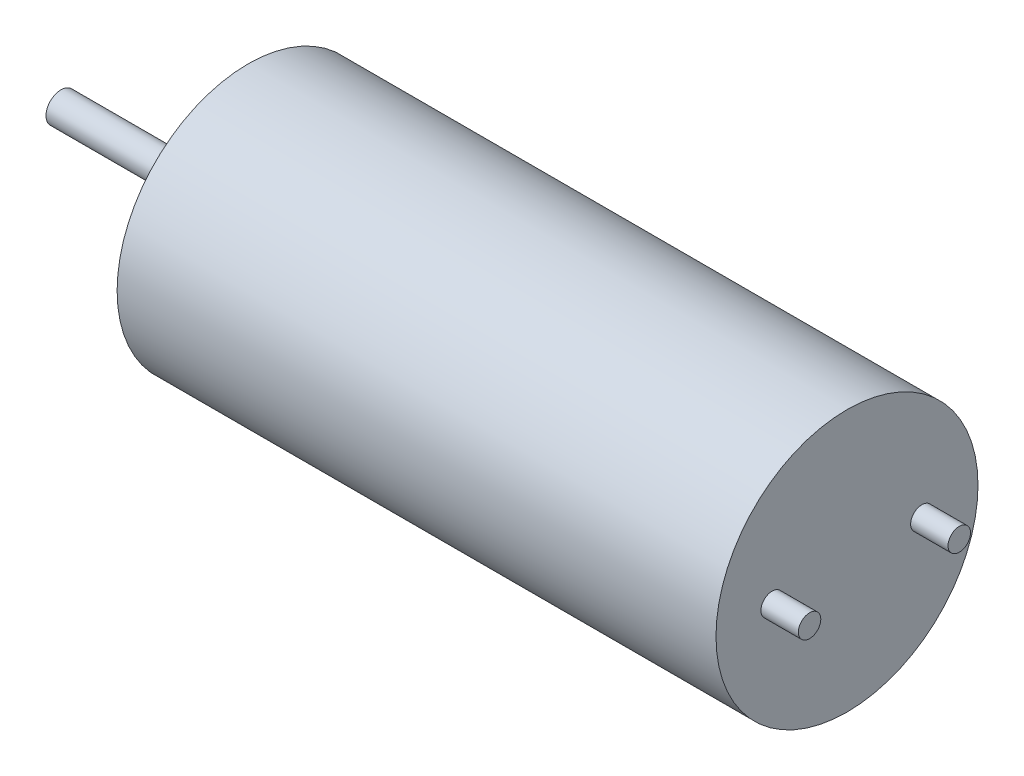
ISO-10303-21;
HEADER;
FILE_DESCRIPTION(('STEP AP214'),'2;1');
FILE_NAME('part.step','',(''),(''),'','','');
FILE_SCHEMA(('AUTOMOTIVE_DESIGN { 1 0 10303 214 1 1 1 1 }'));
ENDSEC;
DATA;
#1=APPLICATION_CONTEXT('core data for automotive mechanical design processes');
#2=APPLICATION_PROTOCOL_DEFINITION('international standard','automotive_design',2000,#1);
#3=PRODUCT_CONTEXT('',#1,'mechanical');
#4=PRODUCT('Part','Part','',(#3));
#5=PRODUCT_RELATED_PRODUCT_CATEGORY('part','',(#4));
#6=PRODUCT_DEFINITION_FORMATION('','',#4);
#7=PRODUCT_DEFINITION_CONTEXT('part definition',#1,'design');
#8=PRODUCT_DEFINITION('design','',#6,#7);
#9=PRODUCT_DEFINITION_SHAPE('','',#8);
#10=(LENGTH_UNIT() NAMED_UNIT(*) SI_UNIT(.MILLI.,.METRE.));
#11=(NAMED_UNIT(*) PLANE_ANGLE_UNIT() SI_UNIT($,.RADIAN.));
#12=(NAMED_UNIT(*) SI_UNIT($,.STERADIAN.) SOLID_ANGLE_UNIT());
#13=UNCERTAINTY_MEASURE_WITH_UNIT(LENGTH_MEASURE(1.E-05),#10,'distance_accuracy_value','');
#14=(GEOMETRIC_REPRESENTATION_CONTEXT(3) GLOBAL_UNCERTAINTY_ASSIGNED_CONTEXT((#13)) GLOBAL_UNIT_ASSIGNED_CONTEXT((#10,
#11,#12)) REPRESENTATION_CONTEXT('',''));
#15=CARTESIAN_POINT('',(0.,0.,0.));
#16=DIRECTION('',(0.,0.,1.));
#17=DIRECTION('',(1.,0.,0.));
#18=AXIS2_PLACEMENT_3D('',#15,#16,#17);
#19=CARTESIAN_POINT('',(16.,0.,0.));
#20=DIRECTION('',(-1.,0.,0.));
#21=DIRECTION('',(0.,0.,1.));
#22=AXIS2_PLACEMENT_3D('',#19,#20,#21);
#23=CYLINDRICAL_SURFACE('',#22,3.5);
#24=CARTESIAN_POINT('',(16.,0.,0.));
#25=DIRECTION('',(1.,0.,0.));
#26=DIRECTION('',(0.,0.,-1.));
#27=AXIS2_PLACEMENT_3D('',#24,#25,#26);
#28=CIRCLE('',#27,3.5);
#29=CARTESIAN_POINT('',(16.,0.,-3.5));
#30=VERTEX_POINT('',#29);
#31=EDGE_CURVE('E51',#30,#30,#28,.T.);
#32=ORIENTED_EDGE('',*,*,#31,.F.);
#33=EDGE_LOOP('',(#32));
#34=FACE_BOUND('',#33,.T.);
#35=CARTESIAN_POINT('',(0.,0.,0.));
#36=DIRECTION('',(1.,0.,0.));
#37=DIRECTION('',(0.,0.,-1.));
#38=AXIS2_PLACEMENT_3D('',#35,#36,#37);
#39=CIRCLE('',#38,3.5);
#40=CARTESIAN_POINT('',(0.,0.,-3.5));
#41=VERTEX_POINT('',#40);
#42=EDGE_CURVE('E40',#41,#41,#39,.T.);
#43=ORIENTED_EDGE('',*,*,#42,.T.);
#44=EDGE_LOOP('',(#43));
#45=FACE_BOUND('',#44,.T.);
#46=ADVANCED_FACE('F37',(#34,#45),#23,.T.);
#47=CARTESIAN_POINT('',(16.,0.,0.));
#48=DIRECTION('',(1.,0.,0.));
#49=DIRECTION('',(0.,0.,-1.));
#50=AXIS2_PLACEMENT_3D('',#47,#48,#49);
#51=PLANE('',#50);
#52=CARTESIAN_POINT('',(16.,0.,-2.));
#53=DIRECTION('',(1.,0.,0.));
#54=DIRECTION('',(0.,0.,-1.));
#55=AXIS2_PLACEMENT_3D('',#52,#53,#54);
#56=CIRCLE('',#55,0.3);
#57=CARTESIAN_POINT('',(16.,0.,-2.3));
#58=VERTEX_POINT('',#57);
#59=EDGE_CURVE('E192',#58,#58,#56,.T.);
#60=ORIENTED_EDGE('',*,*,#59,.F.);
#61=EDGE_LOOP('',(#60));
#62=FACE_BOUND('',#61,.T.);
#63=CARTESIAN_POINT('',(16.,0.,2.));
#64=DIRECTION('',(1.,0.,0.));
#65=DIRECTION('',(0.,0.,-1.));
#66=AXIS2_PLACEMENT_3D('',#63,#64,#65);
#67=CIRCLE('',#66,0.3);
#68=CARTESIAN_POINT('',(16.,0.,1.7));
#69=VERTEX_POINT('',#68);
#70=EDGE_CURVE('E185',#69,#69,#67,.T.);
#71=ORIENTED_EDGE('',*,*,#70,.F.);
#72=EDGE_LOOP('',(#71));
#73=FACE_BOUND('',#72,.T.);
#74=ORIENTED_EDGE('',*,*,#31,.T.);
#75=EDGE_LOOP('',(#74));
#76=FACE_BOUND('',#75,.T.);
#77=ADVANCED_FACE('F72',(#62,#73,#76),#51,.T.);
#78=CARTESIAN_POINT('',(0.,0.,0.));
#79=DIRECTION('',(1.,0.,0.));
#80=DIRECTION('',(0.,0.,-1.));
#81=AXIS2_PLACEMENT_3D('',#78,#79,#80);
#82=PLANE('',#81);
#83=CARTESIAN_POINT('',(0.,0.,0.));
#84=DIRECTION('',(-1.,0.,0.));
#85=DIRECTION('',(0.,0.,1.));
#86=AXIS2_PLACEMENT_3D('',#83,#84,#85);
#87=CIRCLE('',#86,1.2);
#88=CARTESIAN_POINT('',(0.,0.,1.2));
#89=VERTEX_POINT('',#88);
#90=EDGE_CURVE('E45',#89,#89,#87,.T.);
#91=ORIENTED_EDGE('',*,*,#90,.F.);
#92=EDGE_LOOP('',(#91));
#93=FACE_BOUND('',#92,.T.);
#94=ORIENTED_EDGE('',*,*,#42,.F.);
#95=EDGE_LOOP('',(#94));
#96=FACE_BOUND('',#95,.T.);
#97=ADVANCED_FACE('F69',(#93,#96),#82,.F.);
#98=CARTESIAN_POINT('',(-0.8,0.,0.));
#99=DIRECTION('',(1.,0.,0.));
#100=DIRECTION('',(0.,0.,-1.));
#101=AXIS2_PLACEMENT_3D('',#98,#99,#100);
#102=CYLINDRICAL_SURFACE('',#101,1.2);
#103=CARTESIAN_POINT('',(-0.8,0.,0.));
#104=DIRECTION('',(-1.,0.,0.));
#105=DIRECTION('',(0.,0.,1.));
#106=AXIS2_PLACEMENT_3D('',#103,#104,#105);
#107=CIRCLE('',#106,1.2);
#108=CARTESIAN_POINT('',(-0.8,0.,1.2));
#109=VERTEX_POINT('',#108);
#110=EDGE_CURVE('E57',#109,#109,#107,.T.);
#111=ORIENTED_EDGE('',*,*,#110,.F.);
#112=EDGE_LOOP('',(#111));
#113=FACE_BOUND('',#112,.T.);
#114=ORIENTED_EDGE('',*,*,#90,.T.);
#115=EDGE_LOOP('',(#114));
#116=FACE_BOUND('',#115,.T.);
#117=ADVANCED_FACE('F71',(#113,#116),#102,.T.);
#118=CARTESIAN_POINT('',(-0.8,0.,0.));
#119=DIRECTION('',(-1.,0.,0.));
#120=DIRECTION('',(0.,0.,1.));
#121=AXIS2_PLACEMENT_3D('',#118,#119,#120);
#122=PLANE('',#121);
#123=CARTESIAN_POINT('',(-0.8,0.,0.));
#124=DIRECTION('',(-1.,0.,0.));
#125=DIRECTION('',(0.,0.,1.));
#126=AXIS2_PLACEMENT_3D('',#123,#124,#125);
#127=CIRCLE('',#126,0.4);
#128=CARTESIAN_POINT('',(-0.8,0.,0.4));
#129=VERTEX_POINT('',#128);
#130=EDGE_CURVE('E10',#129,#129,#127,.T.);
#131=ORIENTED_EDGE('',*,*,#130,.F.);
#132=EDGE_LOOP('',(#131));
#133=FACE_BOUND('',#132,.T.);
#134=ORIENTED_EDGE('',*,*,#110,.T.);
#135=EDGE_LOOP('',(#134));
#136=FACE_BOUND('',#135,.T.);
#137=ADVANCED_FACE('F78',(#133,#136),#122,.T.);
#138=CARTESIAN_POINT('',(-5.,0.,0.));
#139=DIRECTION('',(1.,0.,0.));
#140=DIRECTION('',(0.,0.,-1.));
#141=AXIS2_PLACEMENT_3D('',#138,#139,#140);
#142=CYLINDRICAL_SURFACE('',#141,0.4);
#143=CARTESIAN_POINT('',(-5.,0.,0.));
#144=DIRECTION('',(-1.,0.,0.));
#145=DIRECTION('',(0.,0.,1.));
#146=AXIS2_PLACEMENT_3D('',#143,#144,#145);
#147=CIRCLE('',#146,0.4);
#148=CARTESIAN_POINT('',(-5.,0.,0.4));
#149=VERTEX_POINT('',#148);
#150=EDGE_CURVE('E55',#149,#149,#147,.T.);
#151=ORIENTED_EDGE('',*,*,#150,.F.);
#152=EDGE_LOOP('',(#151));
#153=FACE_BOUND('',#152,.T.);
#154=ORIENTED_EDGE('',*,*,#130,.T.);
#155=EDGE_LOOP('',(#154));
#156=FACE_BOUND('',#155,.T.);
#157=ADVANCED_FACE('F146',(#153,#156),#142,.T.);
#158=CARTESIAN_POINT('',(-5.,0.,0.));
#159=DIRECTION('',(-1.,0.,0.));
#160=DIRECTION('',(0.,0.,1.));
#161=AXIS2_PLACEMENT_3D('',#158,#159,#160);
#162=PLANE('',#161);
#163=ORIENTED_EDGE('',*,*,#150,.T.);
#164=EDGE_LOOP('',(#163));
#165=FACE_BOUND('',#164,.T.);
#166=ADVANCED_FACE('F99',(#165),#162,.T.);
#167=CARTESIAN_POINT('',(17.,0.,2.));
#168=DIRECTION('',(-1.,0.,0.));
#169=DIRECTION('',(0.,0.,1.));
#170=AXIS2_PLACEMENT_3D('',#167,#168,#169);
#171=CYLINDRICAL_SURFACE('',#170,0.3);
#172=CARTESIAN_POINT('',(17.,0.,2.));
#173=DIRECTION('',(1.,0.,0.));
#174=DIRECTION('',(0.,0.,-1.));
#175=AXIS2_PLACEMENT_3D('',#172,#173,#174);
#176=CIRCLE('',#175,0.3);
#177=CARTESIAN_POINT('',(17.,0.,1.7));
#178=VERTEX_POINT('',#177);
#179=EDGE_CURVE('E182',#178,#178,#176,.T.);
#180=ORIENTED_EDGE('',*,*,#179,.F.);
#181=EDGE_LOOP('',(#180));
#182=FACE_BOUND('',#181,.T.);
#183=ORIENTED_EDGE('',*,*,#70,.T.);
#184=EDGE_LOOP('',(#183));
#185=FACE_BOUND('',#184,.T.);
#186=ADVANCED_FACE('F104',(#182,#185),#171,.T.);
#187=CARTESIAN_POINT('',(17.,0.,2.));
#188=DIRECTION('',(1.,0.,0.));
#189=DIRECTION('',(0.,0.,-1.));
#190=AXIS2_PLACEMENT_3D('',#187,#188,#189);
#191=PLANE('',#190);
#192=ORIENTED_EDGE('',*,*,#179,.T.);
#193=EDGE_LOOP('',(#192));
#194=FACE_BOUND('',#193,.T.);
#195=ADVANCED_FACE('F109',(#194),#191,.T.);
#196=CARTESIAN_POINT('',(17.,0.,-2.));
#197=DIRECTION('',(-1.,0.,0.));
#198=DIRECTION('',(0.,0.,1.));
#199=AXIS2_PLACEMENT_3D('',#196,#197,#198);
#200=CYLINDRICAL_SURFACE('',#199,0.3);
#201=CARTESIAN_POINT('',(17.,0.,-2.));
#202=DIRECTION('',(1.,0.,0.));
#203=DIRECTION('',(0.,0.,-1.));
#204=AXIS2_PLACEMENT_3D('',#201,#202,#203);
#205=CIRCLE('',#204,0.3);
#206=CARTESIAN_POINT('',(17.,0.,-2.3));
#207=VERTEX_POINT('',#206);
#208=EDGE_CURVE('E190',#207,#207,#205,.T.);
#209=ORIENTED_EDGE('',*,*,#208,.F.);
#210=EDGE_LOOP('',(#209));
#211=FACE_BOUND('',#210,.T.);
#212=ORIENTED_EDGE('',*,*,#59,.T.);
#213=EDGE_LOOP('',(#212));
#214=FACE_BOUND('',#213,.T.);
#215=ADVANCED_FACE('F119',(#211,#214),#200,.T.);
#216=CARTESIAN_POINT('',(17.,0.,-2.));
#217=DIRECTION('',(1.,0.,0.));
#218=DIRECTION('',(0.,0.,-1.));
#219=AXIS2_PLACEMENT_3D('',#216,#217,#218);
#220=PLANE('',#219);
#221=ORIENTED_EDGE('',*,*,#208,.T.);
#222=EDGE_LOOP('',(#221));
#223=FACE_BOUND('',#222,.T.);
#224=ADVANCED_FACE('F129',(#223),#220,.T.);
#225=CLOSED_SHELL('',(#46,#77,#97,#117,#137,#157,#166,#186,#195,#215,#224));
#226=MANIFOLD_SOLID_BREP('B2',#225);
#227=ADVANCED_BREP_SHAPE_REPRESENTATION('',(#18,#226),#14);
#228=SHAPE_DEFINITION_REPRESENTATION(#9,#227);
ENDSEC;
END-ISO-10303-21;
